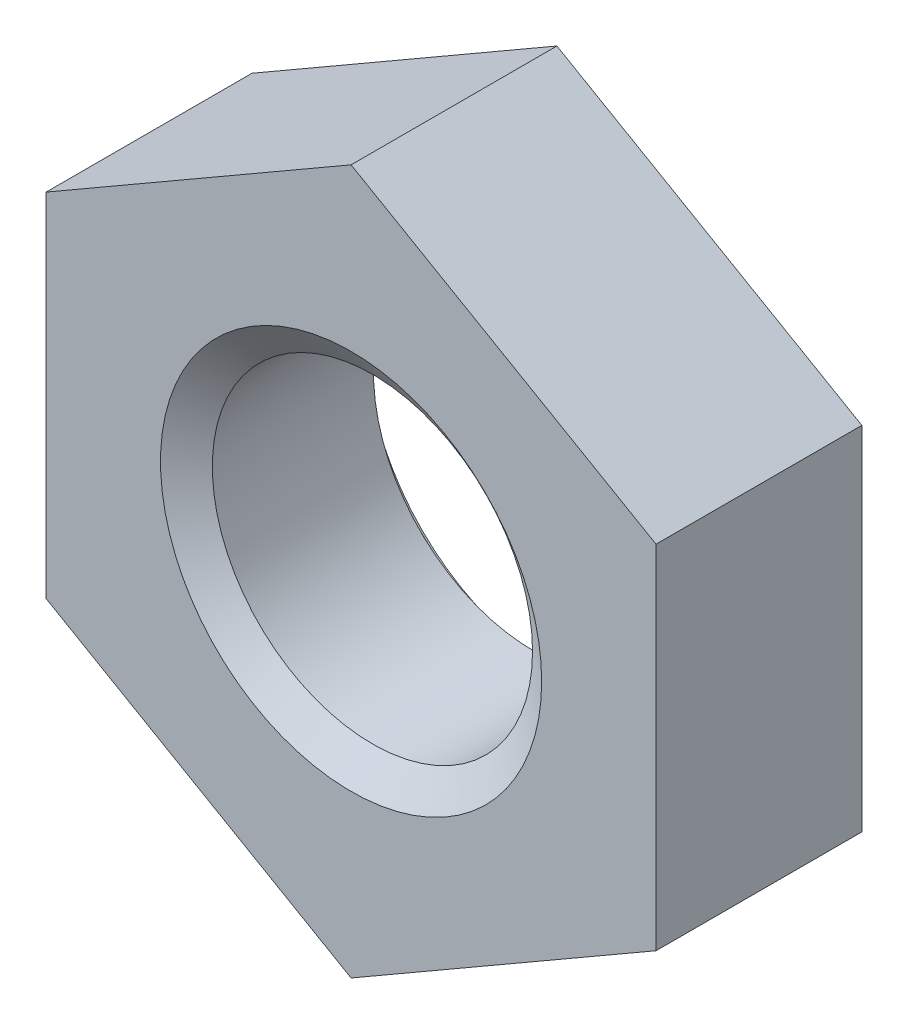
ISO-10303-21;
HEADER;
FILE_DESCRIPTION(('STEP AP214'),'2;1');
FILE_NAME('part.step','',(''),(''),'','','');
FILE_SCHEMA(('AUTOMOTIVE_DESIGN { 1 0 10303 214 1 1 1 1 }'));
ENDSEC;
DATA;
#1=APPLICATION_CONTEXT('core data for automotive mechanical design processes');
#2=APPLICATION_PROTOCOL_DEFINITION('international standard','automotive_design',2000,#1);
#3=PRODUCT_CONTEXT('',#1,'mechanical');
#4=PRODUCT('Part','Part','',(#3));
#5=PRODUCT_RELATED_PRODUCT_CATEGORY('part','',(#4));
#6=PRODUCT_DEFINITION_FORMATION('','',#4);
#7=PRODUCT_DEFINITION_CONTEXT('part definition',#1,'design');
#8=PRODUCT_DEFINITION('design','',#6,#7);
#9=PRODUCT_DEFINITION_SHAPE('','',#8);
#10=(LENGTH_UNIT() NAMED_UNIT(*) SI_UNIT(.MILLI.,.METRE.));
#11=(NAMED_UNIT(*) PLANE_ANGLE_UNIT() SI_UNIT($,.RADIAN.));
#12=(NAMED_UNIT(*) SI_UNIT($,.STERADIAN.) SOLID_ANGLE_UNIT());
#13=UNCERTAINTY_MEASURE_WITH_UNIT(LENGTH_MEASURE(1.E-05),#10,'distance_accuracy_value','');
#14=(GEOMETRIC_REPRESENTATION_CONTEXT(3) GLOBAL_UNCERTAINTY_ASSIGNED_CONTEXT((#13)) GLOBAL_UNIT_ASSIGNED_CONTEXT((#10,
#11,#12)) REPRESENTATION_CONTEXT('',''));
#15=CARTESIAN_POINT('',(0.,0.,0.));
#16=DIRECTION('',(0.,0.,1.));
#17=DIRECTION('',(1.,0.,0.));
#18=AXIS2_PLACEMENT_3D('',#15,#16,#17);
#19=CARTESIAN_POINT('',(0.,0.,-2.7));
#20=DIRECTION('',(0.,0.,1.));
#21=DIRECTION('',(1.,0.,0.));
#22=AXIS2_PLACEMENT_3D('',#19,#20,#21);
#23=CYLINDRICAL_SURFACE('',#22,2.1);
#24=CARTESIAN_POINT('',(0.,0.,-0.280083015283883));
#25=DIRECTION('',(0.,0.,1.));
#26=DIRECTION('',(1.,0.,0.));
#27=AXIS2_PLACEMENT_3D('',#24,#25,#26);
#28=CIRCLE('',#27,2.1);
#29=CARTESIAN_POINT('',(2.1,0.,-0.280083015283884));
#30=VERTEX_POINT('',#29);
#31=EDGE_CURVE('E108',#30,#30,#28,.F.);
#32=CARTESIAN_POINT('',(0.,0.,-2.3945169847161));
#33=DIRECTION('',(0.,0.,-1.));
#34=DIRECTION('',(-1.,0.,0.));
#35=AXIS2_PLACEMENT_3D('',#32,#33,#34);
#36=CIRCLE('',#35,2.1);
#37=CARTESIAN_POINT('',(2.1,0.,-2.3945169847161));
#38=VERTEX_POINT('',#37);
#39=EDGE_CURVE('E37',#38,#38,#36,.F.);
#40=CARTESIAN_POINT('',(2.1,0.,-0.280083015283884));
#41=CARTESIAN_POINT('',(2.1,0.,-0.302108369132136));
#42=CARTESIAN_POINT('',(2.1,0.,-0.324133722980388));
#43=CARTESIAN_POINT('',(2.1,0.,-0.368184430676893));
#44=CARTESIAN_POINT('',(2.1,0.,-0.390209784525145));
#45=CARTESIAN_POINT('',(2.1,0.,-0.43426049222165));
#46=CARTESIAN_POINT('',(2.1,0.,-0.456285846069902));
#47=CARTESIAN_POINT('',(2.1,0.,-0.500336553766406));
#48=CARTESIAN_POINT('',(2.1,0.,-0.522361907614659));
#49=CARTESIAN_POINT('',(2.1,0.,-0.566412615311163));
#50=CARTESIAN_POINT('',(2.1,0.,-0.588437969159416));
#51=CARTESIAN_POINT('',(2.1,0.,-0.63248867685592));
#52=CARTESIAN_POINT('',(2.1,0.,-0.654514030704173));
#53=CARTESIAN_POINT('',(2.1,0.,-0.698564738400677));
#54=CARTESIAN_POINT('',(2.1,0.,-0.720590092248929));
#55=CARTESIAN_POINT('',(2.1,0.,-0.764640799945434));
#56=CARTESIAN_POINT('',(2.1,0.,-0.786666153793686));
#57=CARTESIAN_POINT('',(2.1,0.,-0.830716861490191));
#58=CARTESIAN_POINT('',(2.1,0.,-0.852742215338443));
#59=CARTESIAN_POINT('',(2.1,0.,-0.896792923034948));
#60=CARTESIAN_POINT('',(2.1,0.,-0.9188182768832));
#61=CARTESIAN_POINT('',(2.1,0.,-0.962868984579704));
#62=CARTESIAN_POINT('',(2.1,0.,-0.984894338427957));
#63=CARTESIAN_POINT('',(2.1,0.,-1.02894504612446));
#64=CARTESIAN_POINT('',(2.1,0.,-1.05097039997271));
#65=CARTESIAN_POINT('',(2.1,0.,-1.09502110766922));
#66=CARTESIAN_POINT('',(2.1,0.,-1.11704646151747));
#67=CARTESIAN_POINT('',(2.1,0.,-1.16109716921398));
#68=CARTESIAN_POINT('',(2.1,0.,-1.18312252306223));
#69=CARTESIAN_POINT('',(2.1,0.,-1.22717323075873));
#70=CARTESIAN_POINT('',(2.1,0.,-1.24919858460698));
#71=CARTESIAN_POINT('',(2.1,0.,-1.29324929230349));
#72=CARTESIAN_POINT('',(2.1,0.,-1.31527464615174));
#73=CARTESIAN_POINT('',(2.1,0.,-1.35932535384825));
#74=CARTESIAN_POINT('',(2.1,0.,-1.3813507076965));
#75=CARTESIAN_POINT('',(2.1,0.,-1.425401415393));
#76=CARTESIAN_POINT('',(2.1,0.,-1.44742676924126));
#77=CARTESIAN_POINT('',(2.1,0.,-1.49147747693776));
#78=CARTESIAN_POINT('',(2.1,0.,-1.51350283078601));
#79=CARTESIAN_POINT('',(2.1,0.,-1.55755353848252));
#80=CARTESIAN_POINT('',(2.1,0.,-1.57957889233077));
#81=CARTESIAN_POINT('',(2.1,0.,-1.62362960002727));
#82=CARTESIAN_POINT('',(2.1,0.,-1.64565495387553));
#83=CARTESIAN_POINT('',(2.1,0.,-1.68970566157203));
#84=CARTESIAN_POINT('',(2.1,0.,-1.71173101542028));
#85=CARTESIAN_POINT('',(2.1,0.,-1.75578172311679));
#86=CARTESIAN_POINT('',(2.1,0.,-1.77780707696504));
#87=CARTESIAN_POINT('',(2.1,0.,-1.82185778466154));
#88=CARTESIAN_POINT('',(2.1,0.,-1.8438831385098));
#89=CARTESIAN_POINT('',(2.1,0.,-1.8879338462063));
#90=CARTESIAN_POINT('',(2.1,0.,-1.90995920005455));
#91=CARTESIAN_POINT('',(2.1,0.,-1.95400990775106));
#92=CARTESIAN_POINT('',(2.1,0.,-1.97603526159931));
#93=CARTESIAN_POINT('',(2.1,0.,-2.02008596929581));
#94=CARTESIAN_POINT('',(2.1,0.,-2.04211132314407));
#95=CARTESIAN_POINT('',(2.1,0.,-2.08616203084057));
#96=CARTESIAN_POINT('',(2.1,0.,-2.10818738468882));
#97=CARTESIAN_POINT('',(2.1,0.,-2.15223809238533));
#98=CARTESIAN_POINT('',(2.1,0.,-2.17426344623358));
#99=CARTESIAN_POINT('',(2.1,0.,-2.21831415393009));
#100=CARTESIAN_POINT('',(2.1,0.,-2.24033950777834));
#101=CARTESIAN_POINT('',(2.1,0.,-2.28439021547484));
#102=CARTESIAN_POINT('',(2.1,0.,-2.30641556932309));
#103=CARTESIAN_POINT('',(2.1,0.,-2.3504662770196));
#104=CARTESIAN_POINT('',(2.1,0.,-2.37249163086785));
#105=CARTESIAN_POINT('',(2.1,0.,-2.3945169847161));
#106=B_SPLINE_CURVE_WITH_KNOTS('',3,(#40,#41,#42,#43,#44,#45,#46,#47,#48,#49,#50,#51,#52,#53,
#54,#55,#56,#57,#58,#59,#60,#61,#62,#63,#64,#65,#66,#67,#68,#69,#70,#71,#72,#73,#74,#75,#76,#77,
#78,#79,#80,#81,#82,#83,#84,#85,#86,#87,#88,#89,#90,#91,#92,#93,#94,#95,#96,#97,#98,#99,#100,
#101,#102,#103,#104,#105),.UNSPECIFIED.,.F.,.F.,(4,2,2,2,2,2,2,2,2,2,2,2,2,2,2,2,2,2,2,2,2,2,2,
2,2,2,2,2,2,2,2,2,4),(0.,0.0660760615447567,0.132152123089514,0.19822818463427,
0.264304246179028,0.330380307723784,0.396456369268541,0.462532430813298,0.528608492358055,
0.594684553902812,0.660760615447569,0.726836676992325,0.792912738537082,0.858988800081839,
0.925064861626596,0.991140923171353,1.05721698471611,1.12329304626087,1.18936910780562,
1.25544516935038,1.32152123089514,1.38759729243989,1.45367335398465,1.51974941552941,
1.58582547707416,1.65190153861892,1.71797760016368,1.78405366170844,1.85012972325319,
1.91620578479795,1.98228184634271,2.04835790788746,2.11443396943222),.UNSPECIFIED.);
#107=EDGE_CURVE('BSEAM33',#30,#38,#106,.T.);
#108=ORIENTED_EDGE('',*,*,#31,.F.);
#109=ORIENTED_EDGE('',*,*,#39,.F.);
#110=ORIENTED_EDGE('',*,*,#107,.T.);
#111=ORIENTED_EDGE('',*,*,#107,.F.);
#112=EDGE_LOOP('',(#108,#110,#109,#111));
#113=FACE_BOUND('',#112,.T.);
#114=ADVANCED_FACE('F33',(#113),#23,.F.);
#115=CARTESIAN_POINT('',(0.,4.61880215351702,-2.7));
#116=DIRECTION('',(0.,0.,-1.));
#117=DIRECTION('',(-1.,0.,0.));
#118=AXIS2_PLACEMENT_3D('',#115,#116,#117);
#119=PLANE('',#118);
#120=DIRECTION('',(-0.866025403784437,-0.500000000000003,0.));
#121=VECTOR('',#120,1.);
#122=CARTESIAN_POINT('',(0.,4.61880215351702,-2.7));
#123=LINE('',#122,#121);
#124=CARTESIAN_POINT('',(0.,4.61880215351702,-2.7));
#125=VERTEX_POINT('',#124);
#126=CARTESIAN_POINT('',(-4.,2.30940107675849,-2.7));
#127=VERTEX_POINT('',#126);
#128=EDGE_CURVE('E89',#125,#127,#123,.T.);
#129=ORIENTED_EDGE('',*,*,#128,.F.);
#130=DIRECTION('',(-0.866025403784434,0.500000000000007,0.));
#131=VECTOR('',#130,1.);
#132=CARTESIAN_POINT('',(4.,2.30940107675847,-2.7));
#133=LINE('',#132,#131);
#134=CARTESIAN_POINT('',(4.,2.30940107675847,-2.7));
#135=VERTEX_POINT('',#134);
#136=EDGE_CURVE('E94',#135,#125,#133,.T.);
#137=ORIENTED_EDGE('',*,*,#136,.F.);
#138=DIRECTION('',(0.,-1.,0.));
#139=VECTOR('',#138,1.);
#140=CARTESIAN_POINT('',(4.,2.30940107675847,-2.7));
#141=LINE('',#140,#139);
#142=CARTESIAN_POINT('',(4.,-2.30940107675854,-2.7));
#143=VERTEX_POINT('',#142);
#144=EDGE_CURVE('E133',#135,#143,#141,.T.);
#145=ORIENTED_EDGE('',*,*,#144,.T.);
#146=DIRECTION('',(0.866025403784437,0.500000000000002,0.));
#147=VECTOR('',#146,1.);
#148=CARTESIAN_POINT('',(0.,-4.61880215351707,-2.7));
#149=LINE('',#148,#147);
#150=CARTESIAN_POINT('',(0.,-4.61880215351707,-2.7));
#151=VERTEX_POINT('',#150);
#152=EDGE_CURVE('E130',#151,#143,#149,.T.);
#153=ORIENTED_EDGE('',*,*,#152,.F.);
#154=DIRECTION('',(0.866025403784435,-0.500000000000006,0.));
#155=VECTOR('',#154,1.);
#156=CARTESIAN_POINT('',(-4.,-2.30940107675853,-2.7));
#157=LINE('',#156,#155);
#158=CARTESIAN_POINT('',(-4.,-2.30940107675853,-2.7));
#159=VERTEX_POINT('',#158);
#160=EDGE_CURVE('E127',#159,#151,#157,.T.);
#161=ORIENTED_EDGE('',*,*,#160,.F.);
#162=DIRECTION('',(0.,-1.,0.));
#163=VECTOR('',#162,1.);
#164=CARTESIAN_POINT('',(-4.,2.30940107675849,-2.7));
#165=LINE('',#164,#163);
#166=EDGE_CURVE('E125',#127,#159,#165,.T.);
#167=ORIENTED_EDGE('',*,*,#166,.F.);
#168=EDGE_LOOP('',(#129,#137,#145,#153,#161,#167));
#169=FACE_BOUND('',#168,.T.);
#170=CARTESIAN_POINT('',(0.,0.,-2.7));
#171=DIRECTION('',(0.,0.,-1.));
#172=DIRECTION('',(-1.,0.,0.));
#173=AXIS2_PLACEMENT_3D('',#170,#171,#172);
#174=CIRCLE('',#173,2.5);
#175=CARTESIAN_POINT('',(-2.5,0.,-2.7));
#176=VERTEX_POINT('',#175);
#177=EDGE_CURVE('E141',#176,#176,#174,.F.);
#178=ORIENTED_EDGE('',*,*,#177,.T.);
#179=EDGE_LOOP('',(#178));
#180=FACE_BOUND('',#179,.T.);
#181=ADVANCED_FACE('F160',(#169,#180),#119,.T.);
#182=CARTESIAN_POINT('',(0.,4.61880215351702,0.));
#183=DIRECTION('',(0.,0.,-1.));
#184=DIRECTION('',(-1.,0.,0.));
#185=AXIS2_PLACEMENT_3D('',#182,#183,#184);
#186=PLANE('',#185);
#187=DIRECTION('',(-0.866025403784437,-0.500000000000003,0.));
#188=VECTOR('',#187,1.);
#189=CARTESIAN_POINT('',(0.,4.61880215351702,0.));
#190=LINE('',#189,#188);
#191=CARTESIAN_POINT('',(0.,4.61880215351702,0.));
#192=VERTEX_POINT('',#191);
#193=CARTESIAN_POINT('',(-4.,2.30940107675849,0.));
#194=VERTEX_POINT('',#193);
#195=EDGE_CURVE('E87',#192,#194,#190,.T.);
#196=ORIENTED_EDGE('',*,*,#195,.T.);
#197=DIRECTION('',(0.,-1.,0.));
#198=VECTOR('',#197,1.);
#199=CARTESIAN_POINT('',(-4.,2.30940107675849,0.));
#200=LINE('',#199,#198);
#201=CARTESIAN_POINT('',(-4.,-2.30940107675853,0.));
#202=VERTEX_POINT('',#201);
#203=EDGE_CURVE('E97',#194,#202,#200,.T.);
#204=ORIENTED_EDGE('',*,*,#203,.T.);
#205=DIRECTION('',(0.866025403784435,-0.500000000000006,0.));
#206=VECTOR('',#205,1.);
#207=CARTESIAN_POINT('',(-4.,-2.30940107675853,0.));
#208=LINE('',#207,#206);
#209=CARTESIAN_POINT('',(0.,-4.61880215351707,0.));
#210=VERTEX_POINT('',#209);
#211=EDGE_CURVE('E102',#202,#210,#208,.T.);
#212=ORIENTED_EDGE('',*,*,#211,.T.);
#213=DIRECTION('',(0.866025403784437,0.500000000000002,0.));
#214=VECTOR('',#213,1.);
#215=CARTESIAN_POINT('',(0.,-4.61880215351707,0.));
#216=LINE('',#215,#214);
#217=CARTESIAN_POINT('',(4.,-2.30940107675854,0.));
#218=VERTEX_POINT('',#217);
#219=EDGE_CURVE('E117',#210,#218,#216,.T.);
#220=ORIENTED_EDGE('',*,*,#219,.T.);
#221=DIRECTION('',(0.,-1.,0.));
#222=VECTOR('',#221,1.);
#223=CARTESIAN_POINT('',(4.,2.30940107675847,0.));
#224=LINE('',#223,#222);
#225=CARTESIAN_POINT('',(4.,2.30940107675847,0.));
#226=VERTEX_POINT('',#225);
#227=EDGE_CURVE('E120',#226,#218,#224,.T.);
#228=ORIENTED_EDGE('',*,*,#227,.F.);
#229=DIRECTION('',(-0.866025403784434,0.500000000000007,0.));
#230=VECTOR('',#229,1.);
#231=CARTESIAN_POINT('',(4.,2.30940107675847,0.));
#232=LINE('',#231,#230);
#233=EDGE_CURVE('E107',#226,#192,#232,.T.);
#234=ORIENTED_EDGE('',*,*,#233,.T.);
#235=EDGE_LOOP('',(#196,#204,#212,#220,#228,#234));
#236=FACE_BOUND('',#235,.T.);
#237=CARTESIAN_POINT('',(0.,0.,0.));
#238=DIRECTION('',(0.,0.,1.));
#239=DIRECTION('',(1.,0.,0.));
#240=AXIS2_PLACEMENT_3D('',#237,#238,#239);
#241=CIRCLE('',#240,2.5);
#242=CARTESIAN_POINT('',(2.5,0.,0.));
#243=VERTEX_POINT('',#242);
#244=EDGE_CURVE('E111',#243,#243,#241,.T.);
#245=ORIENTED_EDGE('',*,*,#244,.F.);
#246=EDGE_LOOP('',(#245));
#247=FACE_BOUND('',#246,.T.);
#248=ADVANCED_FACE('F104',(#236,#247),#186,.F.);
#249=CARTESIAN_POINT('',(0.,4.61880215351702,-2.7));
#250=DIRECTION('',(-0.500000000000003,0.866025403784437,0.));
#251=DIRECTION('',(-0.866025403784437,-0.500000000000003,0.));
#252=AXIS2_PLACEMENT_3D('',#249,#250,#251);
#253=PLANE('',#252);
#254=ORIENTED_EDGE('',*,*,#195,.F.);
#255=DIRECTION('',(0.,0.,1.));
#256=VECTOR('',#255,1.);
#257=CARTESIAN_POINT('',(0.,4.61880215351702,-2.7));
#258=LINE('',#257,#256);
#259=EDGE_CURVE('E11',#125,#192,#258,.T.);
#260=ORIENTED_EDGE('',*,*,#259,.F.);
#261=ORIENTED_EDGE('',*,*,#128,.T.);
#262=DIRECTION('',(0.,0.,1.));
#263=VECTOR('',#262,1.);
#264=CARTESIAN_POINT('',(-4.,2.30940107675849,-2.7));
#265=LINE('',#264,#263);
#266=EDGE_CURVE('E84',#127,#194,#265,.T.);
#267=ORIENTED_EDGE('',*,*,#266,.T.);
#268=EDGE_LOOP('',(#254,#260,#261,#267));
#269=FACE_BOUND('',#268,.T.);
#270=ADVANCED_FACE('F35',(#269),#253,.T.);
#271=CARTESIAN_POINT('',(4.,2.30940107675847,-2.7));
#272=DIRECTION('',(0.500000000000007,0.866025403784434,0.));
#273=DIRECTION('',(-0.866025403784435,0.500000000000007,0.));
#274=AXIS2_PLACEMENT_3D('',#271,#272,#273);
#275=PLANE('',#274);
#276=ORIENTED_EDGE('',*,*,#233,.F.);
#277=DIRECTION('',(0.,0.,1.));
#278=VECTOR('',#277,1.);
#279=CARTESIAN_POINT('',(4.,2.30940107675847,-2.7));
#280=LINE('',#279,#278);
#281=EDGE_CURVE('E42',#135,#226,#280,.T.);
#282=ORIENTED_EDGE('',*,*,#281,.F.);
#283=ORIENTED_EDGE('',*,*,#136,.T.);
#284=ORIENTED_EDGE('',*,*,#259,.T.);
#285=EDGE_LOOP('',(#276,#282,#283,#284));
#286=FACE_BOUND('',#285,.T.);
#287=ADVANCED_FACE('F174',(#286),#275,.T.);
#288=CARTESIAN_POINT('',(4.,2.30940107675847,-2.7));
#289=DIRECTION('',(-1.,0.,0.));
#290=DIRECTION('',(0.,0.,1.));
#291=AXIS2_PLACEMENT_3D('',#288,#289,#290);
#292=PLANE('',#291);
#293=ORIENTED_EDGE('',*,*,#227,.T.);
#294=DIRECTION('',(0.,0.,1.));
#295=VECTOR('',#294,1.);
#296=CARTESIAN_POINT('',(4.,-2.30940107675854,-2.7));
#297=LINE('',#296,#295);
#298=EDGE_CURVE('E137',#143,#218,#297,.T.);
#299=ORIENTED_EDGE('',*,*,#298,.F.);
#300=ORIENTED_EDGE('',*,*,#144,.F.);
#301=ORIENTED_EDGE('',*,*,#281,.T.);
#302=EDGE_LOOP('',(#293,#299,#300,#301));
#303=FACE_BOUND('',#302,.T.);
#304=ADVANCED_FACE('F177',(#303),#292,.F.);
#305=CARTESIAN_POINT('',(0.,-4.61880215351707,-2.7));
#306=DIRECTION('',(0.500000000000002,-0.866025403784437,0.));
#307=DIRECTION('',(0.866025403784437,0.500000000000002,0.));
#308=AXIS2_PLACEMENT_3D('',#305,#306,#307);
#309=PLANE('',#308);
#310=ORIENTED_EDGE('',*,*,#219,.F.);
#311=DIRECTION('',(0.,0.,1.));
#312=VECTOR('',#311,1.);
#313=CARTESIAN_POINT('',(0.,-4.61880215351707,-2.7));
#314=LINE('',#313,#312);
#315=EDGE_CURVE('E139',#151,#210,#314,.T.);
#316=ORIENTED_EDGE('',*,*,#315,.F.);
#317=ORIENTED_EDGE('',*,*,#152,.T.);
#318=ORIENTED_EDGE('',*,*,#298,.T.);
#319=EDGE_LOOP('',(#310,#316,#317,#318));
#320=FACE_BOUND('',#319,.T.);
#321=ADVANCED_FACE('F180',(#320),#309,.T.);
#322=CARTESIAN_POINT('',(-4.,-2.30940107675853,-2.7));
#323=DIRECTION('',(-0.500000000000006,-0.866025403784435,0.));
#324=DIRECTION('',(0.866025403784435,-0.500000000000006,0.));
#325=AXIS2_PLACEMENT_3D('',#322,#323,#324);
#326=PLANE('',#325);
#327=ORIENTED_EDGE('',*,*,#211,.F.);
#328=DIRECTION('',(0.,0.,1.));
#329=VECTOR('',#328,1.);
#330=CARTESIAN_POINT('',(-4.,-2.30940107675853,-2.7));
#331=LINE('',#330,#329);
#332=EDGE_CURVE('E93',#159,#202,#331,.T.);
#333=ORIENTED_EDGE('',*,*,#332,.F.);
#334=ORIENTED_EDGE('',*,*,#160,.T.);
#335=ORIENTED_EDGE('',*,*,#315,.T.);
#336=EDGE_LOOP('',(#327,#333,#334,#335));
#337=FACE_BOUND('',#336,.T.);
#338=ADVANCED_FACE('F184',(#337),#326,.T.);
#339=CARTESIAN_POINT('',(-4.,2.30940107675849,-2.7));
#340=DIRECTION('',(-1.,0.,0.));
#341=DIRECTION('',(0.,0.,1.));
#342=AXIS2_PLACEMENT_3D('',#339,#340,#341);
#343=PLANE('',#342);
#344=ORIENTED_EDGE('',*,*,#203,.F.);
#345=ORIENTED_EDGE('',*,*,#266,.F.);
#346=ORIENTED_EDGE('',*,*,#166,.T.);
#347=ORIENTED_EDGE('',*,*,#332,.T.);
#348=EDGE_LOOP('',(#344,#345,#346,#347));
#349=FACE_BOUND('',#348,.T.);
#350=ADVANCED_FACE('F98',(#349),#343,.T.);
#351=CARTESIAN_POINT('',(0.,0.,-0.308091316812271));
#352=DIRECTION('',(0.,0.,1.));
#353=DIRECTION('',(1.,0.,0.));
#354=AXIS2_PLACEMENT_3D('',#351,#352,#353);
#355=CONICAL_SURFACE('',#354,2.06,0.959931088596878);
#356=ORIENTED_EDGE('',*,*,#244,.T.);
#357=EDGE_LOOP('',(#356));
#358=FACE_BOUND('',#357,.T.);
#359=ORIENTED_EDGE('',*,*,#31,.T.);
#360=EDGE_LOOP('',(#359));
#361=FACE_BOUND('',#360,.T.);
#362=ADVANCED_FACE('F155',(#358,#361),#355,.F.);
#363=CARTESIAN_POINT('',(0.,0.,-2.6746));
#364=DIRECTION('',(0.,0.,-1.));
#365=DIRECTION('',(-1.,0.,0.));
#366=AXIS2_PLACEMENT_3D('',#363,#364,#365);
#367=CONICAL_SURFACE('',#366,2.5,0.959931088596863);
#368=CARTESIAN_POINT('',(0.,0.,-2.6746));
#369=DIRECTION('',(0.,0.,1.));
#370=DIRECTION('',(1.,0.,0.));
#371=AXIS2_PLACEMENT_3D('',#368,#369,#370);
#372=CIRCLE('',#371,2.5);
#373=CARTESIAN_POINT('',(2.5,0.,-2.6746));
#374=VERTEX_POINT('',#373);
#375=EDGE_CURVE('E143',#374,#374,#372,.T.);
#376=ORIENTED_EDGE('',*,*,#375,.F.);
#377=EDGE_LOOP('',(#376));
#378=FACE_BOUND('',#377,.T.);
#379=ORIENTED_EDGE('',*,*,#39,.T.);
#380=EDGE_LOOP('',(#379));
#381=FACE_BOUND('',#380,.T.);
#382=ADVANCED_FACE('F152',(#378,#381),#367,.F.);
#383=CARTESIAN_POINT('',(0.,0.,-25.0375057290932));
#384=DIRECTION('',(0.,0.,1.));
#385=DIRECTION('',(1.,0.,0.));
#386=AXIS2_PLACEMENT_3D('',#383,#384,#385);
#387=CYLINDRICAL_SURFACE('',#386,2.5);
#388=ORIENTED_EDGE('',*,*,#177,.F.);
#389=EDGE_LOOP('',(#388));
#390=FACE_BOUND('',#389,.T.);
#391=ORIENTED_EDGE('',*,*,#375,.T.);
#392=EDGE_LOOP('',(#391));
#393=FACE_BOUND('',#392,.T.);
#394=ADVANCED_FACE('F150',(#390,#393),#387,.F.);
#395=CLOSED_SHELL('',(#114,#181,#248,#270,#287,#304,#321,#338,#350,#362,#382,#394));
#396=MANIFOLD_SOLID_BREP('B2',#395);
#397=ADVANCED_BREP_SHAPE_REPRESENTATION('',(#18,#396),#14);
#398=SHAPE_DEFINITION_REPRESENTATION(#9,#397);
ENDSEC;
END-ISO-10303-21;
